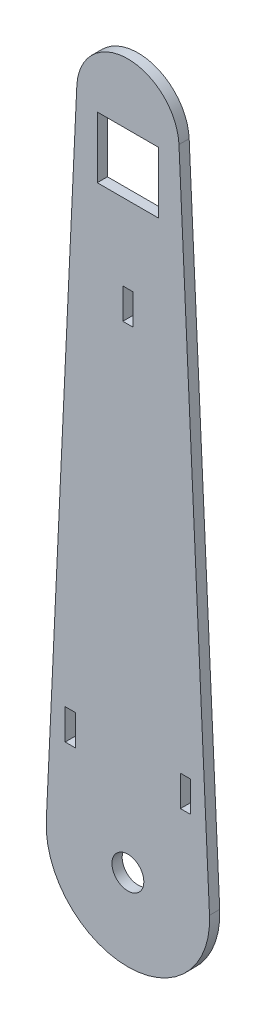
ISO-10303-21;
HEADER;
FILE_DESCRIPTION(('STEP AP214'),'2;1');
FILE_NAME('part.step','',(''),(''),'','','');
FILE_SCHEMA(('AUTOMOTIVE_DESIGN { 1 0 10303 214 1 1 1 1 }'));
ENDSEC;
DATA;
#1=APPLICATION_CONTEXT('core data for automotive mechanical design processes');
#2=APPLICATION_PROTOCOL_DEFINITION('international standard','automotive_design',2000,#1);
#3=PRODUCT_CONTEXT('',#1,'mechanical');
#4=PRODUCT('Part','Part','',(#3));
#5=PRODUCT_RELATED_PRODUCT_CATEGORY('part','',(#4));
#6=PRODUCT_DEFINITION_FORMATION('','',#4);
#7=PRODUCT_DEFINITION_CONTEXT('part definition',#1,'design');
#8=PRODUCT_DEFINITION('design','',#6,#7);
#9=PRODUCT_DEFINITION_SHAPE('','',#8);
#10=(LENGTH_UNIT() NAMED_UNIT(*) SI_UNIT(.MILLI.,.METRE.));
#11=(NAMED_UNIT(*) PLANE_ANGLE_UNIT() SI_UNIT($,.RADIAN.));
#12=(NAMED_UNIT(*) SI_UNIT($,.STERADIAN.) SOLID_ANGLE_UNIT());
#13=UNCERTAINTY_MEASURE_WITH_UNIT(LENGTH_MEASURE(1.E-05),#10,'distance_accuracy_value','');
#14=(GEOMETRIC_REPRESENTATION_CONTEXT(3) GLOBAL_UNCERTAINTY_ASSIGNED_CONTEXT((#13)) GLOBAL_UNIT_ASSIGNED_CONTEXT((#10,
#11,#12)) REPRESENTATION_CONTEXT('',''));
#15=CARTESIAN_POINT('',(0.,0.,0.));
#16=DIRECTION('',(0.,0.,1.));
#17=DIRECTION('',(1.,0.,0.));
#18=AXIS2_PLACEMENT_3D('',#15,#16,#17);
#19=CARTESIAN_POINT('',(0.,0.,3.175));
#20=DIRECTION('',(0.,0.,-1.));
#21=DIRECTION('',(-1.,0.,0.));
#22=AXIS2_PLACEMENT_3D('',#19,#20,#21);
#23=PLANE('',#22);
#24=DIRECTION('',(0.,-1.,0.));
#25=VECTOR('',#24,1.);
#26=CARTESIAN_POINT('',(16.3322,25.4,3.175));
#27=LINE('',#26,#25);
#28=CARTESIAN_POINT('',(16.3322,34.925,3.175));
#29=VERTEX_POINT('',#28);
#30=CARTESIAN_POINT('',(16.3322,25.4,3.175));
#31=VERTEX_POINT('',#30);
#32=EDGE_CURVE('E212',#29,#31,#27,.T.);
#33=ORIENTED_EDGE('',*,*,#32,.F.);
#34=DIRECTION('',(-1.,0.,0.));
#35=VECTOR('',#34,1.);
#36=CARTESIAN_POINT('',(16.3322,34.925,3.175));
#37=LINE('',#36,#35);
#38=CARTESIAN_POINT('',(19.5072,34.925,3.175));
#39=VERTEX_POINT('',#38);
#40=EDGE_CURVE('E220',#39,#29,#37,.T.);
#41=ORIENTED_EDGE('',*,*,#40,.F.);
#42=DIRECTION('',(0.,1.,0.));
#43=VECTOR('',#42,1.);
#44=CARTESIAN_POINT('',(19.5072,25.4,3.175));
#45=LINE('',#44,#43);
#46=CARTESIAN_POINT('',(19.5072,25.4,3.175));
#47=VERTEX_POINT('',#46);
#48=EDGE_CURVE('E217',#47,#39,#45,.T.);
#49=ORIENTED_EDGE('',*,*,#48,.F.);
#50=DIRECTION('',(1.,0.,0.));
#51=VECTOR('',#50,1.);
#52=CARTESIAN_POINT('',(16.3322,25.4,3.175));
#53=LINE('',#52,#51);
#54=EDGE_CURVE('E214',#31,#47,#53,.T.);
#55=ORIENTED_EDGE('',*,*,#54,.F.);
#56=EDGE_LOOP('',(#33,#41,#49,#55));
#57=FACE_BOUND('',#56,.T.);
#58=DIRECTION('',(0.,-1.,0.));
#59=VECTOR('',#58,1.);
#60=CARTESIAN_POINT('',(-19.5072,34.925,3.175));
#61=LINE('',#60,#59);
#62=CARTESIAN_POINT('',(-19.5072,34.925,3.175));
#63=VERTEX_POINT('',#62);
#64=CARTESIAN_POINT('',(-19.5072,25.4,3.175));
#65=VERTEX_POINT('',#64);
#66=EDGE_CURVE('E274',#63,#65,#61,.T.);
#67=ORIENTED_EDGE('',*,*,#66,.F.);
#68=DIRECTION('',(-1.,0.,0.));
#69=VECTOR('',#68,1.);
#70=CARTESIAN_POINT('',(-19.5072,34.925,3.175));
#71=LINE('',#70,#69);
#72=CARTESIAN_POINT('',(-16.3322,34.925,3.175));
#73=VERTEX_POINT('',#72);
#74=EDGE_CURVE('E282',#73,#63,#71,.T.);
#75=ORIENTED_EDGE('',*,*,#74,.F.);
#76=DIRECTION('',(0.,1.,0.));
#77=VECTOR('',#76,1.);
#78=CARTESIAN_POINT('',(-16.3322,34.925,3.175));
#79=LINE('',#78,#77);
#80=CARTESIAN_POINT('',(-16.3322,25.4,3.175));
#81=VERTEX_POINT('',#80);
#82=EDGE_CURVE('E279',#81,#73,#79,.T.);
#83=ORIENTED_EDGE('',*,*,#82,.F.);
#84=DIRECTION('',(1.,0.,0.));
#85=VECTOR('',#84,1.);
#86=CARTESIAN_POINT('',(-19.5072,25.4,3.175));
#87=LINE('',#86,#85);
#88=EDGE_CURVE('E276',#65,#81,#87,.T.);
#89=ORIENTED_EDGE('',*,*,#88,.F.);
#90=EDGE_LOOP('',(#67,#75,#83,#89));
#91=FACE_BOUND('',#90,.T.);
#92=CARTESIAN_POINT('',(0.,0.,3.175));
#93=DIRECTION('',(0.,0.,1.));
#94=DIRECTION('',(-1.,0.,0.));
#95=AXIS2_PLACEMENT_3D('',#92,#93,#94);
#96=CIRCLE('',#95,25.4);
#97=CARTESIAN_POINT('',(-25.3721813861181,1.18844928790486,3.175));
#98=VERTEX_POINT('',#97);
#99=CARTESIAN_POINT('',(25.3721813861181,1.18844928790486,3.175));
#100=VERTEX_POINT('',#99);
#101=EDGE_CURVE('E311',#98,#100,#96,.T.);
#102=ORIENTED_EDGE('',*,*,#101,.T.);
#103=DIRECTION('',(-0.0467893420434984,0.998904778981028,0.));
#104=VECTOR('',#103,1.);
#105=CARTESIAN_POINT('',(25.3721813861181,1.18844928790486,3.175));
#106=LINE('',#105,#104);
#107=CARTESIAN_POINT('',(15.875,203.94359520604,3.175));
#108=VERTEX_POINT('',#107);
#109=EDGE_CURVE('E314',#100,#108,#106,.T.);
#110=ORIENTED_EDGE('',*,*,#109,.T.);
#111=CARTESIAN_POINT('',(0.,203.2,3.175));
#112=DIRECTION('',(0.,0.,1.));
#113=DIRECTION('',(-1.,0.,0.));
#114=AXIS2_PLACEMENT_3D('',#111,#112,#113);
#115=CIRCLE('',#114,15.8924056967611);
#116=CARTESIAN_POINT('',(-15.875,203.94359520604,3.175));
#117=VERTEX_POINT('',#116);
#118=EDGE_CURVE('E317',#108,#117,#115,.T.);
#119=ORIENTED_EDGE('',*,*,#118,.T.);
#120=DIRECTION('',(-0.0467893420434984,-0.998904778981028,0.));
#121=VECTOR('',#120,1.);
#122=CARTESIAN_POINT('',(-25.3721813861181,1.18844928790486,3.175));
#123=LINE('',#122,#121);
#124=EDGE_CURVE('E319',#117,#98,#123,.T.);
#125=ORIENTED_EDGE('',*,*,#124,.T.);
#126=EDGE_LOOP('',(#102,#110,#119,#125));
#127=FACE_BOUND('',#126,.T.);
#128=CARTESIAN_POINT('',(0.,0.,3.175));
#129=DIRECTION('',(0.,0.,1.));
#130=DIRECTION('',(1.,0.,0.));
#131=AXIS2_PLACEMENT_3D('',#128,#129,#130);
#132=CIRCLE('',#131,4.953);
#133=CARTESIAN_POINT('',(4.953,0.,3.175));
#134=VERTEX_POINT('',#133);
#135=EDGE_CURVE('E305',#134,#134,#132,.T.);
#136=ORIENTED_EDGE('',*,*,#135,.F.);
#137=EDGE_LOOP('',(#136));
#138=FACE_BOUND('',#137,.T.);
#139=DIRECTION('',(0.,1.,0.));
#140=VECTOR('',#139,1.);
#141=CARTESIAN_POINT('',(1.5875,147.6375,3.175));
#142=LINE('',#141,#140);
#143=CARTESIAN_POINT('',(1.5875,147.6375,3.175));
#144=VERTEX_POINT('',#143);
#145=CARTESIAN_POINT('',(1.5875,157.1625,3.175));
#146=VERTEX_POINT('',#145);
#147=EDGE_CURVE('E243',#144,#146,#142,.T.);
#148=ORIENTED_EDGE('',*,*,#147,.F.);
#149=DIRECTION('',(1.,0.,0.));
#150=VECTOR('',#149,1.);
#151=CARTESIAN_POINT('',(-1.5875,147.6375,3.175));
#152=LINE('',#151,#150);
#153=CARTESIAN_POINT('',(-1.5875,147.6375,3.175));
#154=VERTEX_POINT('',#153);
#155=EDGE_CURVE('E251',#154,#144,#152,.T.);
#156=ORIENTED_EDGE('',*,*,#155,.F.);
#157=DIRECTION('',(0.,-1.,0.));
#158=VECTOR('',#157,1.);
#159=CARTESIAN_POINT('',(-1.5875,147.6375,3.175));
#160=LINE('',#159,#158);
#161=CARTESIAN_POINT('',(-1.5875,157.1625,3.175));
#162=VERTEX_POINT('',#161);
#163=EDGE_CURVE('E248',#162,#154,#160,.T.);
#164=ORIENTED_EDGE('',*,*,#163,.F.);
#165=DIRECTION('',(-1.,0.,0.));
#166=VECTOR('',#165,1.);
#167=CARTESIAN_POINT('',(-1.5875,157.1625,3.175));
#168=LINE('',#167,#166);
#169=EDGE_CURVE('E245',#146,#162,#168,.T.);
#170=ORIENTED_EDGE('',*,*,#169,.F.);
#171=EDGE_LOOP('',(#148,#156,#164,#170));
#172=FACE_BOUND('',#171,.T.);
#173=DIRECTION('',(0.,1.,0.));
#174=VECTOR('',#173,1.);
#175=CARTESIAN_POINT('',(9.525,180.975,3.175));
#176=LINE('',#175,#174);
#177=CARTESIAN_POINT('',(9.525,180.975,3.175));
#178=VERTEX_POINT('',#177);
#179=CARTESIAN_POINT('',(9.525,200.025,3.175));
#180=VERTEX_POINT('',#179);
#181=EDGE_CURVE('E176',#178,#180,#176,.T.);
#182=ORIENTED_EDGE('',*,*,#181,.F.);
#183=DIRECTION('',(1.,0.,0.));
#184=VECTOR('',#183,1.);
#185=CARTESIAN_POINT('',(-9.52500000000001,180.975,3.175));
#186=LINE('',#185,#184);
#187=CARTESIAN_POINT('',(-9.52500000000001,180.975,3.175));
#188=VERTEX_POINT('',#187);
#189=EDGE_CURVE('E198',#188,#178,#186,.T.);
#190=ORIENTED_EDGE('',*,*,#189,.F.);
#191=DIRECTION('',(0.,-1.,0.));
#192=VECTOR('',#191,1.);
#193=CARTESIAN_POINT('',(-9.52500000000001,180.975,3.175));
#194=LINE('',#193,#192);
#195=CARTESIAN_POINT('',(-9.52500000000001,200.025,3.175));
#196=VERTEX_POINT('',#195);
#197=EDGE_CURVE('E196',#196,#188,#194,.T.);
#198=ORIENTED_EDGE('',*,*,#197,.F.);
#199=DIRECTION('',(-1.,0.,0.));
#200=VECTOR('',#199,1.);
#201=CARTESIAN_POINT('',(-9.52500000000001,200.025,3.175));
#202=LINE('',#201,#200);
#203=EDGE_CURVE('E184',#180,#196,#202,.T.);
#204=ORIENTED_EDGE('',*,*,#203,.F.);
#205=EDGE_LOOP('',(#182,#190,#198,#204));
#206=FACE_BOUND('',#205,.T.);
#207=ADVANCED_FACE('F39',(#57,#91,#127,#138,#172,#206),#23,.F.);
#208=CARTESIAN_POINT('',(0.,0.,0.));
#209=DIRECTION('',(0.,0.,-1.));
#210=DIRECTION('',(-1.,0.,0.));
#211=AXIS2_PLACEMENT_3D('',#208,#209,#210);
#212=PLANE('',#211);
#213=CARTESIAN_POINT('',(0.,0.,0.));
#214=DIRECTION('',(0.,0.,1.));
#215=DIRECTION('',(-1.,0.,0.));
#216=AXIS2_PLACEMENT_3D('',#213,#214,#215);
#217=CIRCLE('',#216,25.4);
#218=CARTESIAN_POINT('',(-25.3721813861181,1.18844928790486,0.));
#219=VERTEX_POINT('',#218);
#220=CARTESIAN_POINT('',(25.3721813861181,1.18844928790486,0.));
#221=VERTEX_POINT('',#220);
#222=EDGE_CURVE('E308',#219,#221,#217,.T.);
#223=ORIENTED_EDGE('',*,*,#222,.F.);
#224=DIRECTION('',(-0.0467893420434984,-0.998904778981028,0.));
#225=VECTOR('',#224,1.);
#226=CARTESIAN_POINT('',(-25.3721813861181,1.18844928790486,0.));
#227=LINE('',#226,#225);
#228=CARTESIAN_POINT('',(-15.875,203.94359520604,0.));
#229=VERTEX_POINT('',#228);
#230=EDGE_CURVE('E315',#229,#219,#227,.T.);
#231=ORIENTED_EDGE('',*,*,#230,.F.);
#232=CARTESIAN_POINT('',(0.,203.2,0.));
#233=DIRECTION('',(0.,0.,1.));
#234=DIRECTION('',(-1.,0.,0.));
#235=AXIS2_PLACEMENT_3D('',#232,#233,#234);
#236=CIRCLE('',#235,15.8924056967611);
#237=CARTESIAN_POINT('',(15.875,203.94359520604,0.));
#238=VERTEX_POINT('',#237);
#239=EDGE_CURVE('E326',#238,#229,#236,.T.);
#240=ORIENTED_EDGE('',*,*,#239,.F.);
#241=DIRECTION('',(-0.0467893420434984,0.998904778981028,0.));
#242=VECTOR('',#241,1.);
#243=CARTESIAN_POINT('',(25.3721813861181,1.18844928790486,0.));
#244=LINE('',#243,#242);
#245=EDGE_CURVE('E324',#221,#238,#244,.T.);
#246=ORIENTED_EDGE('',*,*,#245,.F.);
#247=EDGE_LOOP('',(#223,#231,#240,#246));
#248=FACE_BOUND('',#247,.T.);
#249=CARTESIAN_POINT('',(0.,0.,0.));
#250=DIRECTION('',(0.,0.,1.));
#251=DIRECTION('',(1.,0.,0.));
#252=AXIS2_PLACEMENT_3D('',#249,#250,#251);
#253=CIRCLE('',#252,4.953);
#254=CARTESIAN_POINT('',(4.953,0.,0.));
#255=VERTEX_POINT('',#254);
#256=EDGE_CURVE('E304',#255,#255,#253,.T.);
#257=ORIENTED_EDGE('',*,*,#256,.T.);
#258=EDGE_LOOP('',(#257));
#259=FACE_BOUND('',#258,.T.);
#260=DIRECTION('',(-1.,0.,0.));
#261=VECTOR('',#260,1.);
#262=CARTESIAN_POINT('',(-19.5072,34.925,0.));
#263=LINE('',#262,#261);
#264=CARTESIAN_POINT('',(-16.3322,34.925,0.));
#265=VERTEX_POINT('',#264);
#266=CARTESIAN_POINT('',(-19.5072,34.925,0.));
#267=VERTEX_POINT('',#266);
#268=EDGE_CURVE('E277',#265,#267,#263,.T.);
#269=ORIENTED_EDGE('',*,*,#268,.T.);
#270=DIRECTION('',(0.,-1.,0.));
#271=VECTOR('',#270,1.);
#272=CARTESIAN_POINT('',(-19.5072,34.925,0.));
#273=LINE('',#272,#271);
#274=CARTESIAN_POINT('',(-19.5072,25.4,0.));
#275=VERTEX_POINT('',#274);
#276=EDGE_CURVE('E273',#267,#275,#273,.T.);
#277=ORIENTED_EDGE('',*,*,#276,.T.);
#278=DIRECTION('',(1.,0.,0.));
#279=VECTOR('',#278,1.);
#280=CARTESIAN_POINT('',(-19.5072,25.4,0.));
#281=LINE('',#280,#279);
#282=CARTESIAN_POINT('',(-16.3322,25.4,0.));
#283=VERTEX_POINT('',#282);
#284=EDGE_CURVE('E287',#275,#283,#281,.T.);
#285=ORIENTED_EDGE('',*,*,#284,.T.);
#286=DIRECTION('',(0.,1.,0.));
#287=VECTOR('',#286,1.);
#288=CARTESIAN_POINT('',(-16.3322,34.925,0.));
#289=LINE('',#288,#287);
#290=EDGE_CURVE('E290',#283,#265,#289,.T.);
#291=ORIENTED_EDGE('',*,*,#290,.T.);
#292=EDGE_LOOP('',(#269,#277,#285,#291));
#293=FACE_BOUND('',#292,.T.);
#294=DIRECTION('',(1.,0.,0.));
#295=VECTOR('',#294,1.);
#296=CARTESIAN_POINT('',(-1.5875,147.6375,0.));
#297=LINE('',#296,#295);
#298=CARTESIAN_POINT('',(-1.5875,147.6375,0.));
#299=VERTEX_POINT('',#298);
#300=CARTESIAN_POINT('',(1.5875,147.6375,0.));
#301=VERTEX_POINT('',#300);
#302=EDGE_CURVE('E246',#299,#301,#297,.T.);
#303=ORIENTED_EDGE('',*,*,#302,.T.);
#304=DIRECTION('',(0.,1.,0.));
#305=VECTOR('',#304,1.);
#306=CARTESIAN_POINT('',(1.5875,147.6375,0.));
#307=LINE('',#306,#305);
#308=CARTESIAN_POINT('',(1.5875,157.1625,0.));
#309=VERTEX_POINT('',#308);
#310=EDGE_CURVE('E242',#301,#309,#307,.T.);
#311=ORIENTED_EDGE('',*,*,#310,.T.);
#312=DIRECTION('',(-1.,0.,0.));
#313=VECTOR('',#312,1.);
#314=CARTESIAN_POINT('',(-1.5875,157.1625,0.));
#315=LINE('',#314,#313);
#316=CARTESIAN_POINT('',(-1.5875,157.1625,0.));
#317=VERTEX_POINT('',#316);
#318=EDGE_CURVE('E256',#309,#317,#315,.T.);
#319=ORIENTED_EDGE('',*,*,#318,.T.);
#320=DIRECTION('',(0.,-1.,0.));
#321=VECTOR('',#320,1.);
#322=CARTESIAN_POINT('',(-1.5875,147.6375,0.));
#323=LINE('',#322,#321);
#324=EDGE_CURVE('E259',#317,#299,#323,.T.);
#325=ORIENTED_EDGE('',*,*,#324,.T.);
#326=EDGE_LOOP('',(#303,#311,#319,#325));
#327=FACE_BOUND('',#326,.T.);
#328=DIRECTION('',(-1.,0.,0.));
#329=VECTOR('',#328,1.);
#330=CARTESIAN_POINT('',(16.3322,34.925,0.));
#331=LINE('',#330,#329);
#332=CARTESIAN_POINT('',(19.5072,34.925,0.));
#333=VERTEX_POINT('',#332);
#334=CARTESIAN_POINT('',(16.3322,34.925,0.));
#335=VERTEX_POINT('',#334);
#336=EDGE_CURVE('E215',#333,#335,#331,.T.);
#337=ORIENTED_EDGE('',*,*,#336,.T.);
#338=DIRECTION('',(0.,-1.,0.));
#339=VECTOR('',#338,1.);
#340=CARTESIAN_POINT('',(16.3322,25.4,0.));
#341=LINE('',#340,#339);
#342=CARTESIAN_POINT('',(16.3322,25.4,0.));
#343=VERTEX_POINT('',#342);
#344=EDGE_CURVE('E192',#335,#343,#341,.T.);
#345=ORIENTED_EDGE('',*,*,#344,.T.);
#346=DIRECTION('',(1.,0.,0.));
#347=VECTOR('',#346,1.);
#348=CARTESIAN_POINT('',(16.3322,25.4,0.));
#349=LINE('',#348,#347);
#350=CARTESIAN_POINT('',(19.5072,25.4,0.));
#351=VERTEX_POINT('',#350);
#352=EDGE_CURVE('E225',#343,#351,#349,.T.);
#353=ORIENTED_EDGE('',*,*,#352,.T.);
#354=DIRECTION('',(0.,1.,0.));
#355=VECTOR('',#354,1.);
#356=CARTESIAN_POINT('',(19.5072,25.4,0.));
#357=LINE('',#356,#355);
#358=EDGE_CURVE('E228',#351,#333,#357,.T.);
#359=ORIENTED_EDGE('',*,*,#358,.T.);
#360=EDGE_LOOP('',(#337,#345,#353,#359));
#361=FACE_BOUND('',#360,.T.);
#362=DIRECTION('',(1.,0.,0.));
#363=VECTOR('',#362,1.);
#364=CARTESIAN_POINT('',(-9.52500000000001,180.975,0.));
#365=LINE('',#364,#363);
#366=CARTESIAN_POINT('',(-9.52500000000001,180.975,0.));
#367=VERTEX_POINT('',#366);
#368=CARTESIAN_POINT('',(9.525,180.975,0.));
#369=VERTEX_POINT('',#368);
#370=EDGE_CURVE('E185',#367,#369,#365,.T.);
#371=ORIENTED_EDGE('',*,*,#370,.T.);
#372=DIRECTION('',(0.,1.,0.));
#373=VECTOR('',#372,1.);
#374=CARTESIAN_POINT('',(9.525,180.975,0.));
#375=LINE('',#374,#373);
#376=CARTESIAN_POINT('',(9.525,200.025,0.));
#377=VERTEX_POINT('',#376);
#378=EDGE_CURVE('E62',#369,#377,#375,.T.);
#379=ORIENTED_EDGE('',*,*,#378,.T.);
#380=DIRECTION('',(-1.,0.,0.));
#381=VECTOR('',#380,1.);
#382=CARTESIAN_POINT('',(-9.52500000000001,200.025,0.));
#383=LINE('',#382,#381);
#384=CARTESIAN_POINT('',(-9.52500000000001,200.025,0.));
#385=VERTEX_POINT('',#384);
#386=EDGE_CURVE('E191',#377,#385,#383,.T.);
#387=ORIENTED_EDGE('',*,*,#386,.T.);
#388=DIRECTION('',(0.,-1.,0.));
#389=VECTOR('',#388,1.);
#390=CARTESIAN_POINT('',(-9.52500000000001,180.975,0.));
#391=LINE('',#390,#389);
#392=EDGE_CURVE('E204',#385,#367,#391,.T.);
#393=ORIENTED_EDGE('',*,*,#392,.T.);
#394=EDGE_LOOP('',(#371,#379,#387,#393));
#395=FACE_BOUND('',#394,.T.);
#396=ADVANCED_FACE('F344',(#248,#259,#293,#327,#361,#395),#212,.T.);
#397=CARTESIAN_POINT('',(0.,0.,3.175));
#398=DIRECTION('',(0.,0.,-1.));
#399=DIRECTION('',(-1.,0.,0.));
#400=AXIS2_PLACEMENT_3D('',#397,#398,#399);
#401=CYLINDRICAL_SURFACE('',#400,25.4);
#402=ORIENTED_EDGE('',*,*,#222,.T.);
#403=DIRECTION('',(0.,0.,-1.));
#404=VECTOR('',#403,1.);
#405=CARTESIAN_POINT('',(25.3721813861181,1.18844928790486,3.175));
#406=LINE('',#405,#404);
#407=EDGE_CURVE('E11',#100,#221,#406,.T.);
#408=ORIENTED_EDGE('',*,*,#407,.F.);
#409=ORIENTED_EDGE('',*,*,#101,.F.);
#410=DIRECTION('',(0.,0.,-1.));
#411=VECTOR('',#410,1.);
#412=CARTESIAN_POINT('',(-25.3721813861181,1.18844928790486,3.175));
#413=LINE('',#412,#411);
#414=EDGE_CURVE('E321',#98,#219,#413,.T.);
#415=ORIENTED_EDGE('',*,*,#414,.T.);
#416=EDGE_LOOP('',(#402,#408,#409,#415));
#417=FACE_BOUND('',#416,.T.);
#418=ADVANCED_FACE('F41',(#417),#401,.T.);
#419=CARTESIAN_POINT('',(25.3721813861181,1.18844928790486,3.175));
#420=DIRECTION('',(-0.998904778981028,-0.0467893420434984,0.));
#421=DIRECTION('',(0.0467893420434984,-0.998904778981028,0.));
#422=AXIS2_PLACEMENT_3D('',#419,#420,#421);
#423=PLANE('',#422);
#424=ORIENTED_EDGE('',*,*,#245,.T.);
#425=DIRECTION('',(0.,0.,-1.));
#426=VECTOR('',#425,1.);
#427=CARTESIAN_POINT('',(15.875,203.94359520604,3.175));
#428=LINE('',#427,#426);
#429=EDGE_CURVE('E47',#108,#238,#428,.T.);
#430=ORIENTED_EDGE('',*,*,#429,.F.);
#431=ORIENTED_EDGE('',*,*,#109,.F.);
#432=ORIENTED_EDGE('',*,*,#407,.T.);
#433=EDGE_LOOP('',(#424,#430,#431,#432));
#434=FACE_BOUND('',#433,.T.);
#435=ADVANCED_FACE('F355',(#434),#423,.F.);
#436=CARTESIAN_POINT('',(0.,203.2,3.175));
#437=DIRECTION('',(0.,0.,-1.));
#438=DIRECTION('',(-1.,0.,0.));
#439=AXIS2_PLACEMENT_3D('',#436,#437,#438);
#440=CYLINDRICAL_SURFACE('',#439,15.8924056967611);
#441=ORIENTED_EDGE('',*,*,#239,.T.);
#442=DIRECTION('',(0.,0.,-1.));
#443=VECTOR('',#442,1.);
#444=CARTESIAN_POINT('',(-15.875,203.94359520604,3.175));
#445=LINE('',#444,#443);
#446=EDGE_CURVE('E331',#117,#229,#445,.T.);
#447=ORIENTED_EDGE('',*,*,#446,.F.);
#448=ORIENTED_EDGE('',*,*,#118,.F.);
#449=ORIENTED_EDGE('',*,*,#429,.T.);
#450=EDGE_LOOP('',(#441,#447,#448,#449));
#451=FACE_BOUND('',#450,.T.);
#452=ADVANCED_FACE('F338',(#451),#440,.T.);
#453=CARTESIAN_POINT('',(-25.3721813861181,1.18844928790486,3.175));
#454=DIRECTION('',(0.998904778981028,-0.0467893420434984,0.));
#455=DIRECTION('',(0.0467893420434984,0.998904778981028,0.));
#456=AXIS2_PLACEMENT_3D('',#453,#454,#455);
#457=PLANE('',#456);
#458=ORIENTED_EDGE('',*,*,#230,.T.);
#459=ORIENTED_EDGE('',*,*,#414,.F.);
#460=ORIENTED_EDGE('',*,*,#124,.F.);
#461=ORIENTED_EDGE('',*,*,#446,.T.);
#462=EDGE_LOOP('',(#458,#459,#460,#461));
#463=FACE_BOUND('',#462,.T.);
#464=ADVANCED_FACE('F348',(#463),#457,.F.);
#465=CARTESIAN_POINT('',(0.,0.,3.175));
#466=DIRECTION('',(0.,0.,-1.));
#467=DIRECTION('',(-1.,0.,0.));
#468=AXIS2_PLACEMENT_3D('',#465,#466,#467);
#469=CYLINDRICAL_SURFACE('',#468,4.953);
#470=ORIENTED_EDGE('',*,*,#135,.T.);
#471=EDGE_LOOP('',(#470));
#472=FACE_BOUND('',#471,.T.);
#473=ORIENTED_EDGE('',*,*,#256,.F.);
#474=EDGE_LOOP('',(#473));
#475=FACE_BOUND('',#474,.T.);
#476=ADVANCED_FACE('F372',(#472,#475),#469,.F.);
#477=CARTESIAN_POINT('',(-19.5072,34.925,3.175));
#478=DIRECTION('',(1.,0.,0.));
#479=DIRECTION('',(0.,0.,-1.));
#480=AXIS2_PLACEMENT_3D('',#477,#478,#479);
#481=PLANE('',#480);
#482=ORIENTED_EDGE('',*,*,#276,.F.);
#483=DIRECTION('',(0.,0.,-1.));
#484=VECTOR('',#483,1.);
#485=CARTESIAN_POINT('',(-19.5072,34.925,3.175));
#486=LINE('',#485,#484);
#487=EDGE_CURVE('E284',#63,#267,#486,.T.);
#488=ORIENTED_EDGE('',*,*,#487,.F.);
#489=ORIENTED_EDGE('',*,*,#66,.T.);
#490=DIRECTION('',(0.,0.,-1.));
#491=VECTOR('',#490,1.);
#492=CARTESIAN_POINT('',(-19.5072,25.4,3.175));
#493=LINE('',#492,#491);
#494=EDGE_CURVE('E301',#65,#275,#493,.T.);
#495=ORIENTED_EDGE('',*,*,#494,.T.);
#496=EDGE_LOOP('',(#482,#488,#489,#495));
#497=FACE_BOUND('',#496,.T.);
#498=ADVANCED_FACE('F379',(#497),#481,.T.);
#499=CARTESIAN_POINT('',(-19.5072,25.4,3.175));
#500=DIRECTION('',(0.,1.,0.));
#501=DIRECTION('',(0.,0.,1.));
#502=AXIS2_PLACEMENT_3D('',#499,#500,#501);
#503=PLANE('',#502);
#504=ORIENTED_EDGE('',*,*,#284,.F.);
#505=ORIENTED_EDGE('',*,*,#494,.F.);
#506=ORIENTED_EDGE('',*,*,#88,.T.);
#507=DIRECTION('',(0.,0.,-1.));
#508=VECTOR('',#507,1.);
#509=CARTESIAN_POINT('',(-16.3322,25.4,3.175));
#510=LINE('',#509,#508);
#511=EDGE_CURVE('E299',#81,#283,#510,.T.);
#512=ORIENTED_EDGE('',*,*,#511,.T.);
#513=EDGE_LOOP('',(#504,#505,#506,#512));
#514=FACE_BOUND('',#513,.T.);
#515=ADVANCED_FACE('F384',(#514),#503,.T.);
#516=CARTESIAN_POINT('',(-16.3322,34.925,3.175));
#517=DIRECTION('',(-1.,0.,0.));
#518=DIRECTION('',(0.,-1.,0.));
#519=AXIS2_PLACEMENT_3D('',#516,#517,#518);
#520=PLANE('',#519);
#521=ORIENTED_EDGE('',*,*,#290,.F.);
#522=ORIENTED_EDGE('',*,*,#511,.F.);
#523=ORIENTED_EDGE('',*,*,#82,.T.);
#524=DIRECTION('',(0.,0.,-1.));
#525=VECTOR('',#524,1.);
#526=CARTESIAN_POINT('',(-16.3322,34.925,3.175));
#527=LINE('',#526,#525);
#528=EDGE_CURVE('E297',#73,#265,#527,.T.);
#529=ORIENTED_EDGE('',*,*,#528,.T.);
#530=EDGE_LOOP('',(#521,#522,#523,#529));
#531=FACE_BOUND('',#530,.T.);
#532=ADVANCED_FACE('F446',(#531),#520,.T.);
#533=CARTESIAN_POINT('',(-19.5072,34.925,3.175));
#534=DIRECTION('',(0.,-1.,0.));
#535=DIRECTION('',(0.,0.,-1.));
#536=AXIS2_PLACEMENT_3D('',#533,#534,#535);
#537=PLANE('',#536);
#538=ORIENTED_EDGE('',*,*,#268,.F.);
#539=ORIENTED_EDGE('',*,*,#528,.F.);
#540=ORIENTED_EDGE('',*,*,#74,.T.);
#541=ORIENTED_EDGE('',*,*,#487,.T.);
#542=EDGE_LOOP('',(#538,#539,#540,#541));
#543=FACE_BOUND('',#542,.T.);
#544=ADVANCED_FACE('F442',(#543),#537,.T.);
#545=CARTESIAN_POINT('',(1.5875,147.6375,3.175));
#546=DIRECTION('',(-1.,0.,0.));
#547=DIRECTION('',(0.,0.,1.));
#548=AXIS2_PLACEMENT_3D('',#545,#546,#547);
#549=PLANE('',#548);
#550=ORIENTED_EDGE('',*,*,#310,.F.);
#551=DIRECTION('',(0.,0.,-1.));
#552=VECTOR('',#551,1.);
#553=CARTESIAN_POINT('',(1.5875,147.6375,3.175));
#554=LINE('',#553,#552);
#555=EDGE_CURVE('E253',#144,#301,#554,.T.);
#556=ORIENTED_EDGE('',*,*,#555,.F.);
#557=ORIENTED_EDGE('',*,*,#147,.T.);
#558=DIRECTION('',(0.,0.,-1.));
#559=VECTOR('',#558,1.);
#560=CARTESIAN_POINT('',(1.5875,157.1625,3.175));
#561=LINE('',#560,#559);
#562=EDGE_CURVE('E270',#146,#309,#561,.T.);
#563=ORIENTED_EDGE('',*,*,#562,.T.);
#564=EDGE_LOOP('',(#550,#556,#557,#563));
#565=FACE_BOUND('',#564,.T.);
#566=ADVANCED_FACE('F438',(#565),#549,.T.);
#567=CARTESIAN_POINT('',(-1.5875,157.1625,3.175));
#568=DIRECTION('',(0.,-1.,0.));
#569=DIRECTION('',(0.,0.,-1.));
#570=AXIS2_PLACEMENT_3D('',#567,#568,#569);
#571=PLANE('',#570);
#572=ORIENTED_EDGE('',*,*,#318,.F.);
#573=ORIENTED_EDGE('',*,*,#562,.F.);
#574=ORIENTED_EDGE('',*,*,#169,.T.);
#575=DIRECTION('',(0.,0.,-1.));
#576=VECTOR('',#575,1.);
#577=CARTESIAN_POINT('',(-1.5875,157.1625,3.175));
#578=LINE('',#577,#576);
#579=EDGE_CURVE('E268',#162,#317,#578,.T.);
#580=ORIENTED_EDGE('',*,*,#579,.T.);
#581=EDGE_LOOP('',(#572,#573,#574,#580));
#582=FACE_BOUND('',#581,.T.);
#583=ADVANCED_FACE('F434',(#582),#571,.T.);
#584=CARTESIAN_POINT('',(-1.5875,147.6375,3.175));
#585=DIRECTION('',(1.,0.,0.));
#586=DIRECTION('',(0.,0.,-1.));
#587=AXIS2_PLACEMENT_3D('',#584,#585,#586);
#588=PLANE('',#587);
#589=ORIENTED_EDGE('',*,*,#324,.F.);
#590=ORIENTED_EDGE('',*,*,#579,.F.);
#591=ORIENTED_EDGE('',*,*,#163,.T.);
#592=DIRECTION('',(0.,0.,-1.));
#593=VECTOR('',#592,1.);
#594=CARTESIAN_POINT('',(-1.5875,147.6375,3.175));
#595=LINE('',#594,#593);
#596=EDGE_CURVE('E266',#154,#299,#595,.T.);
#597=ORIENTED_EDGE('',*,*,#596,.T.);
#598=EDGE_LOOP('',(#589,#590,#591,#597));
#599=FACE_BOUND('',#598,.T.);
#600=ADVANCED_FACE('F430',(#599),#588,.T.);
#601=CARTESIAN_POINT('',(-1.5875,147.6375,3.175));
#602=DIRECTION('',(0.,1.,0.));
#603=DIRECTION('',(0.,0.,1.));
#604=AXIS2_PLACEMENT_3D('',#601,#602,#603);
#605=PLANE('',#604);
#606=ORIENTED_EDGE('',*,*,#302,.F.);
#607=ORIENTED_EDGE('',*,*,#596,.F.);
#608=ORIENTED_EDGE('',*,*,#155,.T.);
#609=ORIENTED_EDGE('',*,*,#555,.T.);
#610=EDGE_LOOP('',(#606,#607,#608,#609));
#611=FACE_BOUND('',#610,.T.);
#612=ADVANCED_FACE('F426',(#611),#605,.T.);
#613=CARTESIAN_POINT('',(16.3322,25.4,3.175));
#614=DIRECTION('',(1.,0.,0.));
#615=DIRECTION('',(0.,0.,-1.));
#616=AXIS2_PLACEMENT_3D('',#613,#614,#615);
#617=PLANE('',#616);
#618=ORIENTED_EDGE('',*,*,#344,.F.);
#619=DIRECTION('',(0.,0.,-1.));
#620=VECTOR('',#619,1.);
#621=CARTESIAN_POINT('',(16.3322,34.925,3.175));
#622=LINE('',#621,#620);
#623=EDGE_CURVE('E222',#29,#335,#622,.T.);
#624=ORIENTED_EDGE('',*,*,#623,.F.);
#625=ORIENTED_EDGE('',*,*,#32,.T.);
#626=DIRECTION('',(0.,0.,-1.));
#627=VECTOR('',#626,1.);
#628=CARTESIAN_POINT('',(16.3322,25.4,3.175));
#629=LINE('',#628,#627);
#630=EDGE_CURVE('E239',#31,#343,#629,.T.);
#631=ORIENTED_EDGE('',*,*,#630,.T.);
#632=EDGE_LOOP('',(#618,#624,#625,#631));
#633=FACE_BOUND('',#632,.T.);
#634=ADVANCED_FACE('F422',(#633),#617,.T.);
#635=CARTESIAN_POINT('',(16.3322,25.4,3.175));
#636=DIRECTION('',(0.,1.,0.));
#637=DIRECTION('',(0.,0.,1.));
#638=AXIS2_PLACEMENT_3D('',#635,#636,#637);
#639=PLANE('',#638);
#640=ORIENTED_EDGE('',*,*,#352,.F.);
#641=ORIENTED_EDGE('',*,*,#630,.F.);
#642=ORIENTED_EDGE('',*,*,#54,.T.);
#643=DIRECTION('',(0.,0.,-1.));
#644=VECTOR('',#643,1.);
#645=CARTESIAN_POINT('',(19.5072,25.4,3.175));
#646=LINE('',#645,#644);
#647=EDGE_CURVE('E237',#47,#351,#646,.T.);
#648=ORIENTED_EDGE('',*,*,#647,.T.);
#649=EDGE_LOOP('',(#640,#641,#642,#648));
#650=FACE_BOUND('',#649,.T.);
#651=ADVANCED_FACE('F418',(#650),#639,.T.);
#652=CARTESIAN_POINT('',(19.5072,25.4,3.175));
#653=DIRECTION('',(-1.,0.,0.));
#654=DIRECTION('',(0.,0.,1.));
#655=AXIS2_PLACEMENT_3D('',#652,#653,#654);
#656=PLANE('',#655);
#657=ORIENTED_EDGE('',*,*,#358,.F.);
#658=ORIENTED_EDGE('',*,*,#647,.F.);
#659=ORIENTED_EDGE('',*,*,#48,.T.);
#660=DIRECTION('',(0.,0.,-1.));
#661=VECTOR('',#660,1.);
#662=CARTESIAN_POINT('',(19.5072,34.925,3.175));
#663=LINE('',#662,#661);
#664=EDGE_CURVE('E235',#39,#333,#663,.T.);
#665=ORIENTED_EDGE('',*,*,#664,.T.);
#666=EDGE_LOOP('',(#657,#658,#659,#665));
#667=FACE_BOUND('',#666,.T.);
#668=ADVANCED_FACE('F414',(#667),#656,.T.);
#669=CARTESIAN_POINT('',(16.3322,34.925,3.175));
#670=DIRECTION('',(0.,-1.,0.));
#671=DIRECTION('',(0.,0.,-1.));
#672=AXIS2_PLACEMENT_3D('',#669,#670,#671);
#673=PLANE('',#672);
#674=ORIENTED_EDGE('',*,*,#336,.F.);
#675=ORIENTED_EDGE('',*,*,#664,.F.);
#676=ORIENTED_EDGE('',*,*,#40,.T.);
#677=ORIENTED_EDGE('',*,*,#623,.T.);
#678=EDGE_LOOP('',(#674,#675,#676,#677));
#679=FACE_BOUND('',#678,.T.);
#680=ADVANCED_FACE('F411',(#679),#673,.T.);
#681=CARTESIAN_POINT('',(9.525,180.975,3.175));
#682=DIRECTION('',(-1.,0.,0.));
#683=DIRECTION('',(0.,0.,1.));
#684=AXIS2_PLACEMENT_3D('',#681,#682,#683);
#685=PLANE('',#684);
#686=ORIENTED_EDGE('',*,*,#378,.F.);
#687=DIRECTION('',(0.,0.,-1.));
#688=VECTOR('',#687,1.);
#689=CARTESIAN_POINT('',(9.525,180.975,3.175));
#690=LINE('',#689,#688);
#691=EDGE_CURVE('E180',#178,#369,#690,.T.);
#692=ORIENTED_EDGE('',*,*,#691,.F.);
#693=ORIENTED_EDGE('',*,*,#181,.T.);
#694=DIRECTION('',(0.,0.,-1.));
#695=VECTOR('',#694,1.);
#696=CARTESIAN_POINT('',(9.525,200.025,3.175));
#697=LINE('',#696,#695);
#698=EDGE_CURVE('E179',#180,#377,#697,.T.);
#699=ORIENTED_EDGE('',*,*,#698,.T.);
#700=EDGE_LOOP('',(#686,#692,#693,#699));
#701=FACE_BOUND('',#700,.T.);
#702=ADVANCED_FACE('F178',(#701),#685,.T.);
#703=CARTESIAN_POINT('',(-9.52500000000001,200.025,3.175));
#704=DIRECTION('',(0.,-1.,0.));
#705=DIRECTION('',(0.,0.,-1.));
#706=AXIS2_PLACEMENT_3D('',#703,#704,#705);
#707=PLANE('',#706);
#708=ORIENTED_EDGE('',*,*,#386,.F.);
#709=ORIENTED_EDGE('',*,*,#698,.F.);
#710=ORIENTED_EDGE('',*,*,#203,.T.);
#711=DIRECTION('',(0.,0.,-1.));
#712=VECTOR('',#711,1.);
#713=CARTESIAN_POINT('',(-9.52500000000001,200.025,3.175));
#714=LINE('',#713,#712);
#715=EDGE_CURVE('E193',#196,#385,#714,.T.);
#716=ORIENTED_EDGE('',*,*,#715,.T.);
#717=EDGE_LOOP('',(#708,#709,#710,#716));
#718=FACE_BOUND('',#717,.T.);
#719=ADVANCED_FACE('F188',(#718),#707,.T.);
#720=CARTESIAN_POINT('',(-9.52500000000001,180.975,3.175));
#721=DIRECTION('',(1.,0.,0.));
#722=DIRECTION('',(0.,0.,-1.));
#723=AXIS2_PLACEMENT_3D('',#720,#721,#722);
#724=PLANE('',#723);
#725=ORIENTED_EDGE('',*,*,#392,.F.);
#726=ORIENTED_EDGE('',*,*,#715,.F.);
#727=ORIENTED_EDGE('',*,*,#197,.T.);
#728=DIRECTION('',(0.,0.,-1.));
#729=VECTOR('',#728,1.);
#730=CARTESIAN_POINT('',(-9.52500000000001,180.975,3.175));
#731=LINE('',#730,#729);
#732=EDGE_CURVE('E54',#188,#367,#731,.T.);
#733=ORIENTED_EDGE('',*,*,#732,.T.);
#734=EDGE_LOOP('',(#725,#726,#727,#733));
#735=FACE_BOUND('',#734,.T.);
#736=ADVANCED_FACE('F399',(#735),#724,.T.);
#737=CARTESIAN_POINT('',(-9.52500000000001,180.975,3.175));
#738=DIRECTION('',(0.,1.,0.));
#739=DIRECTION('',(0.,0.,1.));
#740=AXIS2_PLACEMENT_3D('',#737,#738,#739);
#741=PLANE('',#740);
#742=ORIENTED_EDGE('',*,*,#370,.F.);
#743=ORIENTED_EDGE('',*,*,#732,.F.);
#744=ORIENTED_EDGE('',*,*,#189,.T.);
#745=ORIENTED_EDGE('',*,*,#691,.T.);
#746=EDGE_LOOP('',(#742,#743,#744,#745));
#747=FACE_BOUND('',#746,.T.);
#748=ADVANCED_FACE('F397',(#747),#741,.T.);
#749=CLOSED_SHELL('',(#207,#396,#418,#435,#452,#464,#476,#498,#515,#532,#544,#566,#583,#600,
#612,#634,#651,#668,#680,#702,#719,#736,#748));
#750=MANIFOLD_SOLID_BREP('B2',#749);
#751=ADVANCED_BREP_SHAPE_REPRESENTATION('',(#18,#750),#14);
#752=SHAPE_DEFINITION_REPRESENTATION(#9,#751);
ENDSEC;
END-ISO-10303-21;
